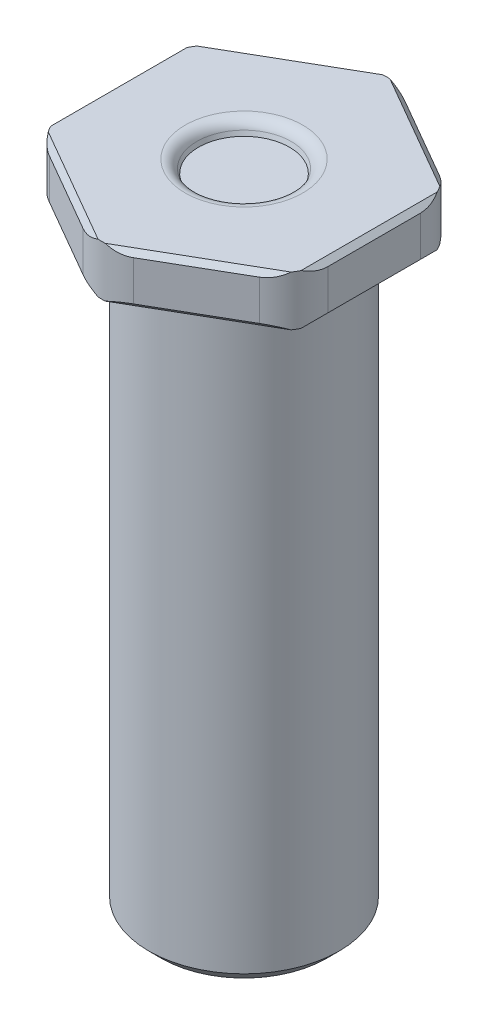
ISO-10303-21;
HEADER;
FILE_DESCRIPTION(('STEP AP214'),'2;1');
FILE_NAME('part.step','',(''),(''),'','','');
FILE_SCHEMA(('AUTOMOTIVE_DESIGN { 1 0 10303 214 1 1 1 1 }'));
ENDSEC;
DATA;
#1=APPLICATION_CONTEXT('core data for automotive mechanical design processes');
#2=APPLICATION_PROTOCOL_DEFINITION('international standard','automotive_design',2000,#1);
#3=PRODUCT_CONTEXT('',#1,'mechanical');
#4=PRODUCT('Part','Part','',(#3));
#5=PRODUCT_RELATED_PRODUCT_CATEGORY('part','',(#4));
#6=PRODUCT_DEFINITION_FORMATION('','',#4);
#7=PRODUCT_DEFINITION_CONTEXT('part definition',#1,'design');
#8=PRODUCT_DEFINITION('design','',#6,#7);
#9=PRODUCT_DEFINITION_SHAPE('','',#8);
#10=(LENGTH_UNIT() NAMED_UNIT(*) SI_UNIT(.MILLI.,.METRE.));
#11=(NAMED_UNIT(*) PLANE_ANGLE_UNIT() SI_UNIT($,.RADIAN.));
#12=(NAMED_UNIT(*) SI_UNIT($,.STERADIAN.) SOLID_ANGLE_UNIT());
#13=UNCERTAINTY_MEASURE_WITH_UNIT(LENGTH_MEASURE(1.E-05),#10,'distance_accuracy_value','');
#14=(GEOMETRIC_REPRESENTATION_CONTEXT(3) GLOBAL_UNCERTAINTY_ASSIGNED_CONTEXT((#13)) GLOBAL_UNIT_ASSIGNED_CONTEXT((#10,
#11,#12)) REPRESENTATION_CONTEXT('',''));
#15=CARTESIAN_POINT('',(0.,0.,0.));
#16=DIRECTION('',(0.,0.,1.));
#17=DIRECTION('',(1.,0.,0.));
#18=AXIS2_PLACEMENT_3D('',#15,#16,#17);
#19=CARTESIAN_POINT('',(0.,63.5,0.));
#20=DIRECTION('',(0.,-1.,0.));
#21=DIRECTION('',(0.,0.,-1.));
#22=AXIS2_PLACEMENT_3D('',#19,#20,#21);
#23=CYLINDRICAL_SURFACE('',#22,9.652);
#24=CARTESIAN_POINT('',(0.,1.27000000000002,0.));
#25=DIRECTION('',(0.,1.,0.));
#26=DIRECTION('',(0.,0.,1.));
#27=AXIS2_PLACEMENT_3D('',#24,#25,#26);
#28=CIRCLE('',#27,9.652);
#29=CARTESIAN_POINT('',(0.,1.27000000000002,9.652));
#30=VERTEX_POINT('',#29);
#31=EDGE_CURVE('E546',#30,#30,#28,.T.);
#32=ORIENTED_EDGE('',*,*,#31,.T.);
#33=EDGE_LOOP('',(#32));
#34=FACE_BOUND('',#33,.T.);
#35=CARTESIAN_POINT('',(0.,60.96,0.));
#36=DIRECTION('',(0.,1.,0.));
#37=DIRECTION('',(0.,0.,1.));
#38=AXIS2_PLACEMENT_3D('',#35,#36,#37);
#39=CIRCLE('',#38,9.652);
#40=CARTESIAN_POINT('',(0.,60.96,9.652));
#41=VERTEX_POINT('',#40);
#42=EDGE_CURVE('E538',#41,#41,#39,.T.);
#43=ORIENTED_EDGE('',*,*,#42,.F.);
#44=EDGE_LOOP('',(#43));
#45=FACE_BOUND('',#44,.T.);
#46=ADVANCED_FACE('F34',(#34,#45),#23,.T.);
#47=CARTESIAN_POINT('',(0.,0.,0.));
#48=DIRECTION('',(0.,1.,0.));
#49=DIRECTION('',(0.,0.,1.));
#50=AXIS2_PLACEMENT_3D('',#47,#48,#49);
#51=PLANE('',#50);
#52=CARTESIAN_POINT('',(0.,0.,0.));
#53=DIRECTION('',(0.,1.,0.));
#54=DIRECTION('',(0.,0.,1.));
#55=AXIS2_PLACEMENT_3D('',#52,#53,#54);
#56=CIRCLE('',#55,8.38199999999997);
#57=CARTESIAN_POINT('',(0.,0.,8.38199999999997));
#58=VERTEX_POINT('',#57);
#59=EDGE_CURVE('E541',#58,#58,#56,.F.);
#60=ORIENTED_EDGE('',*,*,#59,.T.);
#61=EDGE_LOOP('',(#60));
#62=FACE_BOUND('',#61,.T.);
#63=ADVANCED_FACE('F296',(#62),#51,.F.);
#64=CARTESIAN_POINT('',(0.,1.27000000000002,0.));
#65=DIRECTION('',(0.,1.,0.));
#66=DIRECTION('',(0.,0.,1.));
#67=AXIS2_PLACEMENT_3D('',#64,#65,#66);
#68=CONICAL_SURFACE('',#67,9.652,0.78539816339745);
#69=ORIENTED_EDGE('',*,*,#59,.F.);
#70=EDGE_LOOP('',(#69));
#71=FACE_BOUND('',#70,.T.);
#72=ORIENTED_EDGE('',*,*,#31,.F.);
#73=EDGE_LOOP('',(#72));
#74=FACE_BOUND('',#73,.T.);
#75=ADVANCED_FACE('F302',(#71,#74),#68,.T.);
#76=CARTESIAN_POINT('',(0.,60.96,0.));
#77=DIRECTION('',(0.,1.,0.));
#78=DIRECTION('',(0.,0.,1.));
#79=AXIS2_PLACEMENT_3D('',#76,#77,#78);
#80=PLANE('',#79);
#81=DIRECTION('',(0.,0.,-1.));
#82=VECTOR('',#81,1.);
#83=CARTESIAN_POINT('',(-12.6902271536748,60.96,0.));
#84=LINE('',#83,#82);
#85=CARTESIAN_POINT('',(-12.6902271536748,60.96,6.90138129583535));
#86=VERTEX_POINT('',#85);
#87=CARTESIAN_POINT('',(-12.6902271536748,60.96,-6.90138129583534));
#88=VERTEX_POINT('',#87);
#89=EDGE_CURVE('E437',#86,#88,#84,.T.);
#90=ORIENTED_EDGE('',*,*,#89,.T.);
#91=CARTESIAN_POINT('',(-8.11822715367484,60.96,-4.68706063251669));
#92=DIRECTION('',(0.,1.,0.));
#93=DIRECTION('',(0.,0.,1.));
#94=AXIS2_PLACEMENT_3D('',#91,#92,#93);
#95=CIRCLE('',#94,5.08);
#96=CARTESIAN_POINT('',(-12.3218851002336,60.96,-7.53936844695982));
#97=VERTEX_POINT('',#96);
#98=EDGE_CURVE('E466',#88,#97,#95,.F.);
#99=ORIENTED_EDGE('',*,*,#98,.T.);
#100=DIRECTION('',(0.866025403784439,0.,-0.5));
#101=VECTOR('',#100,1.);
#102=CARTESIAN_POINT('',(-6.34511357683742,60.96,-10.9900590948775));
#103=LINE('',#102,#101);
#104=CARTESIAN_POINT('',(-0.368342053441244,60.96,-14.4407497427952));
#105=VERTEX_POINT('',#104);
#106=EDGE_CURVE('E446',#97,#105,#103,.T.);
#107=ORIENTED_EDGE('',*,*,#106,.T.);
#108=CARTESIAN_POINT('',(0.,60.96,-9.37412126503338));
#109=DIRECTION('',(0.,1.,0.));
#110=DIRECTION('',(0.,0.,1.));
#111=AXIS2_PLACEMENT_3D('',#108,#109,#110);
#112=CIRCLE('',#111,5.08);
#113=CARTESIAN_POINT('',(0.368342053441237,60.96,-14.4407497427952));
#114=VERTEX_POINT('',#113);
#115=EDGE_CURVE('E462',#105,#114,#112,.F.);
#116=ORIENTED_EDGE('',*,*,#115,.T.);
#117=DIRECTION('',(0.866025403784439,0.,0.5));
#118=VECTOR('',#117,1.);
#119=CARTESIAN_POINT('',(6.34511357683741,60.96,-10.9900590948775));
#120=LINE('',#119,#118);
#121=CARTESIAN_POINT('',(12.3218851002336,60.96,-7.53936844695983));
#122=VERTEX_POINT('',#121);
#123=EDGE_CURVE('E210',#114,#122,#120,.T.);
#124=ORIENTED_EDGE('',*,*,#123,.T.);
#125=CARTESIAN_POINT('',(8.11822715367482,60.96,-4.6870606325167));
#126=DIRECTION('',(0.,1.,0.));
#127=DIRECTION('',(0.,0.,1.));
#128=AXIS2_PLACEMENT_3D('',#125,#126,#127);
#129=CIRCLE('',#128,5.08);
#130=CARTESIAN_POINT('',(12.6902271536748,60.96,-6.90138129583535));
#131=VERTEX_POINT('',#130);
#132=EDGE_CURVE('E460',#122,#131,#129,.F.);
#133=ORIENTED_EDGE('',*,*,#132,.T.);
#134=DIRECTION('',(0.,0.,1.));
#135=VECTOR('',#134,1.);
#136=CARTESIAN_POINT('',(12.6902271536748,60.96,0.));
#137=LINE('',#136,#135);
#138=CARTESIAN_POINT('',(12.6902271536748,60.96,6.90138129583534));
#139=VERTEX_POINT('',#138);
#140=EDGE_CURVE('E443',#131,#139,#137,.T.);
#141=ORIENTED_EDGE('',*,*,#140,.T.);
#142=CARTESIAN_POINT('',(8.11822715367482,60.96,4.6870606325167));
#143=DIRECTION('',(0.,1.,0.));
#144=DIRECTION('',(0.,0.,1.));
#145=AXIS2_PLACEMENT_3D('',#142,#143,#144);
#146=CIRCLE('',#145,5.08);
#147=CARTESIAN_POINT('',(12.3218851002336,60.96,7.53936844695984));
#148=VERTEX_POINT('',#147);
#149=EDGE_CURVE('E458',#139,#148,#146,.F.);
#150=ORIENTED_EDGE('',*,*,#149,.T.);
#151=DIRECTION('',(-0.866025403784439,0.,0.5));
#152=VECTOR('',#151,1.);
#153=CARTESIAN_POINT('',(6.34511357683742,60.96,10.9900590948775));
#154=LINE('',#153,#152);
#155=CARTESIAN_POINT('',(0.368342053441251,60.96,14.4407497427952));
#156=VERTEX_POINT('',#155);
#157=EDGE_CURVE('E440',#148,#156,#154,.T.);
#158=ORIENTED_EDGE('',*,*,#157,.T.);
#159=CARTESIAN_POINT('',(0.,60.96,9.37412126503338));
#160=DIRECTION('',(0.,1.,0.));
#161=DIRECTION('',(0.,0.,1.));
#162=AXIS2_PLACEMENT_3D('',#159,#160,#161);
#163=CIRCLE('',#162,5.08);
#164=CARTESIAN_POINT('',(-0.368342053441251,60.96,14.4407497427952));
#165=VERTEX_POINT('',#164);
#166=EDGE_CURVE('E456',#156,#165,#163,.F.);
#167=ORIENTED_EDGE('',*,*,#166,.T.);
#168=DIRECTION('',(-0.866025403784439,0.,-0.5));
#169=VECTOR('',#168,1.);
#170=CARTESIAN_POINT('',(-6.34511357683742,60.96,10.9900590948775));
#171=LINE('',#170,#169);
#172=CARTESIAN_POINT('',(-12.3218851002336,60.96,7.53936844695984));
#173=VERTEX_POINT('',#172);
#174=EDGE_CURVE('E434',#165,#173,#171,.T.);
#175=ORIENTED_EDGE('',*,*,#174,.T.);
#176=CARTESIAN_POINT('',(-8.11822715367483,60.96,4.68706063251669));
#177=DIRECTION('',(0.,1.,0.));
#178=DIRECTION('',(0.,0.,1.));
#179=AXIS2_PLACEMENT_3D('',#176,#177,#178);
#180=CIRCLE('',#179,5.08);
#181=EDGE_CURVE('E464',#173,#86,#180,.F.);
#182=ORIENTED_EDGE('',*,*,#181,.T.);
#183=EDGE_LOOP('',(#90,#99,#107,#116,#124,#133,#141,#150,#158,#167,#175,#182));
#184=FACE_BOUND('',#183,.T.);
#185=ORIENTED_EDGE('',*,*,#42,.T.);
#186=EDGE_LOOP('',(#185));
#187=FACE_BOUND('',#186,.T.);
#188=ADVANCED_FACE('F311',(#184,#187),#80,.F.);
#189=CARTESIAN_POINT('',(13.1982271536748,66.04,-7.62));
#190=DIRECTION('',(-0.5,0.,0.866025403784439));
#191=DIRECTION('',(0.866025403784439,0.,0.5));
#192=AXIS2_PLACEMENT_3D('',#189,#190,#191);
#193=PLANE('',#192);
#194=DIRECTION('',(-0.866025403784439,0.,-0.5));
#195=VECTOR('',#194,1.);
#196=CARTESIAN_POINT('',(13.1982271536748,61.468,-7.62));
#197=LINE('',#196,#195);
#198=CARTESIAN_POINT('',(10.6582271536748,61.468,-9.08646968374165));
#199=VERTEX_POINT('',#198);
#200=CARTESIAN_POINT('',(2.54,61.468,-13.7735303162583));
#201=VERTEX_POINT('',#200);
#202=EDGE_CURVE('E428',#199,#201,#197,.T.);
#203=ORIENTED_EDGE('',*,*,#202,.T.);
#204=DIRECTION('',(0.,-1.,0.));
#205=VECTOR('',#204,1.);
#206=CARTESIAN_POINT('',(2.54,66.04,-13.7735303162583));
#207=LINE('',#206,#205);
#208=CARTESIAN_POINT('',(2.54,65.532,-13.7735303162583));
#209=VERTEX_POINT('',#208);
#210=EDGE_CURVE('E251',#201,#209,#207,.F.);
#211=ORIENTED_EDGE('',*,*,#210,.T.);
#212=DIRECTION('',(0.866025403784439,0.,0.5));
#213=VECTOR('',#212,1.);
#214=CARTESIAN_POINT('',(13.1982271536748,65.532,-7.62));
#215=LINE('',#214,#213);
#216=CARTESIAN_POINT('',(10.6582271536748,65.532,-9.08646968374165));
#217=VERTEX_POINT('',#216);
#218=EDGE_CURVE('E431',#209,#217,#215,.T.);
#219=ORIENTED_EDGE('',*,*,#218,.T.);
#220=DIRECTION('',(0.,-1.,0.));
#221=VECTOR('',#220,1.);
#222=CARTESIAN_POINT('',(10.6582271536748,66.04,-9.08646968374165));
#223=LINE('',#222,#221);
#224=EDGE_CURVE('E248',#217,#199,#223,.T.);
#225=ORIENTED_EDGE('',*,*,#224,.T.);
#226=EDGE_LOOP('',(#203,#211,#219,#225));
#227=FACE_BOUND('',#226,.T.);
#228=ADVANCED_FACE('F556',(#227),#193,.F.);
#229=CARTESIAN_POINT('',(0.,66.04,-15.24));
#230=DIRECTION('',(0.5,0.,0.866025403784439));
#231=DIRECTION('',(0.866025403784439,0.,-0.5));
#232=AXIS2_PLACEMENT_3D('',#229,#230,#231);
#233=PLANE('',#232);
#234=DIRECTION('',(-0.866025403784439,0.,0.5));
#235=VECTOR('',#234,1.);
#236=CARTESIAN_POINT('',(0.,61.468,-15.24));
#237=LINE('',#236,#235);
#238=CARTESIAN_POINT('',(-2.54,61.468,-13.7735303162583));
#239=VERTEX_POINT('',#238);
#240=CARTESIAN_POINT('',(-10.6582271536748,61.468,-9.08646968374164));
#241=VERTEX_POINT('',#240);
#242=EDGE_CURVE('E219',#239,#241,#237,.T.);
#243=ORIENTED_EDGE('',*,*,#242,.T.);
#244=DIRECTION('',(0.,-1.,0.));
#245=VECTOR('',#244,1.);
#246=CARTESIAN_POINT('',(-10.6582271536748,66.04,-9.08646968374164));
#247=LINE('',#246,#245);
#248=CARTESIAN_POINT('',(-10.6582271536748,65.532,-9.08646968374164));
#249=VERTEX_POINT('',#248);
#250=EDGE_CURVE('E475',#241,#249,#247,.F.);
#251=ORIENTED_EDGE('',*,*,#250,.T.);
#252=DIRECTION('',(0.866025403784439,0.,-0.5));
#253=VECTOR('',#252,1.);
#254=CARTESIAN_POINT('',(0.,65.532,-15.24));
#255=LINE('',#254,#253);
#256=CARTESIAN_POINT('',(-2.54,65.532,-13.7735303162583));
#257=VERTEX_POINT('',#256);
#258=EDGE_CURVE('E425',#249,#257,#255,.T.);
#259=ORIENTED_EDGE('',*,*,#258,.T.);
#260=DIRECTION('',(0.,-1.,0.));
#261=VECTOR('',#260,1.);
#262=CARTESIAN_POINT('',(-2.54,66.04,-13.7735303162583));
#263=LINE('',#262,#261);
#264=EDGE_CURVE('E472',#257,#239,#263,.T.);
#265=ORIENTED_EDGE('',*,*,#264,.T.);
#266=EDGE_LOOP('',(#243,#251,#259,#265));
#267=FACE_BOUND('',#266,.T.);
#268=ADVANCED_FACE('F501',(#267),#233,.F.);
#269=CARTESIAN_POINT('',(-13.1982271536748,66.04,-7.61999999999999));
#270=DIRECTION('',(1.,0.,0.));
#271=DIRECTION('',(0.,0.,-1.));
#272=AXIS2_PLACEMENT_3D('',#269,#270,#271);
#273=PLANE('',#272);
#274=DIRECTION('',(0.,0.,-1.));
#275=VECTOR('',#274,1.);
#276=CARTESIAN_POINT('',(-13.1982271536748,65.532,-7.61999999999999));
#277=LINE('',#276,#275);
#278=CARTESIAN_POINT('',(-13.1982271536748,65.532,4.68706063251669));
#279=VERTEX_POINT('',#278);
#280=CARTESIAN_POINT('',(-13.1982271536748,65.532,-4.68706063251669));
#281=VERTEX_POINT('',#280);
#282=EDGE_CURVE('E202',#279,#281,#277,.T.);
#283=ORIENTED_EDGE('',*,*,#282,.T.);
#284=DIRECTION('',(0.,-1.,0.));
#285=VECTOR('',#284,1.);
#286=CARTESIAN_POINT('',(-13.1982271536748,66.04,-4.68706063251669));
#287=LINE('',#286,#285);
#288=CARTESIAN_POINT('',(-13.1982271536748,61.468,-4.68706063251669));
#289=VERTEX_POINT('',#288);
#290=EDGE_CURVE('E209',#281,#289,#287,.T.);
#291=ORIENTED_EDGE('',*,*,#290,.T.);
#292=DIRECTION('',(0.,0.,1.));
#293=VECTOR('',#292,1.);
#294=CARTESIAN_POINT('',(-13.1982271536748,61.468,-7.61999999999999));
#295=LINE('',#294,#293);
#296=CARTESIAN_POINT('',(-13.1982271536748,61.468,4.68706063251669));
#297=VERTEX_POINT('',#296);
#298=EDGE_CURVE('E205',#289,#297,#295,.T.);
#299=ORIENTED_EDGE('',*,*,#298,.T.);
#300=DIRECTION('',(0.,-1.,0.));
#301=VECTOR('',#300,1.);
#302=CARTESIAN_POINT('',(-13.1982271536748,66.04,4.68706063251669));
#303=LINE('',#302,#301);
#304=EDGE_CURVE('E198',#297,#279,#303,.F.);
#305=ORIENTED_EDGE('',*,*,#304,.T.);
#306=EDGE_LOOP('',(#283,#291,#299,#305));
#307=FACE_BOUND('',#306,.T.);
#308=ADVANCED_FACE('F200',(#307),#273,.F.);
#309=CARTESIAN_POINT('',(-13.1982271536748,66.04,7.62));
#310=DIRECTION('',(0.5,0.,-0.866025403784439));
#311=DIRECTION('',(-0.866025403784439,0.,-0.5));
#312=AXIS2_PLACEMENT_3D('',#309,#310,#311);
#313=PLANE('',#312);
#314=DIRECTION('',(-0.866025403784439,0.,-0.5));
#315=VECTOR('',#314,1.);
#316=CARTESIAN_POINT('',(-13.1982271536748,65.532,7.62));
#317=LINE('',#316,#315);
#318=CARTESIAN_POINT('',(-2.54,65.532,13.7735303162583));
#319=VERTEX_POINT('',#318);
#320=CARTESIAN_POINT('',(-10.6582271536748,65.532,9.08646968374164));
#321=VERTEX_POINT('',#320);
#322=EDGE_CURVE('E393',#319,#321,#317,.T.);
#323=ORIENTED_EDGE('',*,*,#322,.T.);
#324=DIRECTION('',(0.,-1.,0.));
#325=VECTOR('',#324,1.);
#326=CARTESIAN_POINT('',(-10.6582271536748,66.04,9.08646968374164));
#327=LINE('',#326,#325);
#328=CARTESIAN_POINT('',(-10.6582271536748,61.468,9.08646968374164));
#329=VERTEX_POINT('',#328);
#330=EDGE_CURVE('E233',#321,#329,#327,.T.);
#331=ORIENTED_EDGE('',*,*,#330,.T.);
#332=DIRECTION('',(0.866025403784439,0.,0.5));
#333=VECTOR('',#332,1.);
#334=CARTESIAN_POINT('',(-13.1982271536748,61.468,7.62));
#335=LINE('',#334,#333);
#336=CARTESIAN_POINT('',(-2.54,61.468,13.7735303162583));
#337=VERTEX_POINT('',#336);
#338=EDGE_CURVE('E418',#329,#337,#335,.T.);
#339=ORIENTED_EDGE('',*,*,#338,.T.);
#340=DIRECTION('',(0.,-1.,0.));
#341=VECTOR('',#340,1.);
#342=CARTESIAN_POINT('',(-2.54,66.04,13.7735303162583));
#343=LINE('',#342,#341);
#344=EDGE_CURVE('E227',#337,#319,#343,.F.);
#345=ORIENTED_EDGE('',*,*,#344,.T.);
#346=EDGE_LOOP('',(#323,#331,#339,#345));
#347=FACE_BOUND('',#346,.T.);
#348=ADVANCED_FACE('F568',(#347),#313,.F.);
#349=CARTESIAN_POINT('',(0.,66.04,15.24));
#350=DIRECTION('',(-0.5,0.,-0.866025403784439));
#351=DIRECTION('',(-0.866025403784439,0.,0.5));
#352=AXIS2_PLACEMENT_3D('',#349,#350,#351);
#353=PLANE('',#352);
#354=DIRECTION('',(0.866025403784439,0.,-0.5));
#355=VECTOR('',#354,1.);
#356=CARTESIAN_POINT('',(0.,61.468,15.24));
#357=LINE('',#356,#355);
#358=CARTESIAN_POINT('',(2.54,61.468,13.7735303162583));
#359=VERTEX_POINT('',#358);
#360=CARTESIAN_POINT('',(10.6582271536748,61.468,9.08646968374165));
#361=VERTEX_POINT('',#360);
#362=EDGE_CURVE('E414',#359,#361,#357,.T.);
#363=ORIENTED_EDGE('',*,*,#362,.T.);
#364=DIRECTION('',(0.,-1.,0.));
#365=VECTOR('',#364,1.);
#366=CARTESIAN_POINT('',(10.6582271536748,66.04,9.08646968374165));
#367=LINE('',#366,#365);
#368=CARTESIAN_POINT('',(10.6582271536748,65.532,9.08646968374165));
#369=VERTEX_POINT('',#368);
#370=EDGE_CURVE('E56',#361,#369,#367,.F.);
#371=ORIENTED_EDGE('',*,*,#370,.T.);
#372=DIRECTION('',(-0.866025403784439,0.,0.5));
#373=VECTOR('',#372,1.);
#374=CARTESIAN_POINT('',(0.,65.532,15.24));
#375=LINE('',#374,#373);
#376=CARTESIAN_POINT('',(2.54,65.532,13.7735303162583));
#377=VERTEX_POINT('',#376);
#378=EDGE_CURVE('E416',#369,#377,#375,.T.);
#379=ORIENTED_EDGE('',*,*,#378,.T.);
#380=DIRECTION('',(0.,-1.,0.));
#381=VECTOR('',#380,1.);
#382=CARTESIAN_POINT('',(2.54,66.04,13.7735303162583));
#383=LINE('',#382,#381);
#384=EDGE_CURVE('E274',#377,#359,#383,.T.);
#385=ORIENTED_EDGE('',*,*,#384,.T.);
#386=EDGE_LOOP('',(#363,#371,#379,#385));
#387=FACE_BOUND('',#386,.T.);
#388=ADVANCED_FACE('F517',(#387),#353,.F.);
#389=CARTESIAN_POINT('',(13.1982271536748,66.04,7.62));
#390=DIRECTION('',(-1.,0.,0.));
#391=DIRECTION('',(0.,0.,1.));
#392=AXIS2_PLACEMENT_3D('',#389,#390,#391);
#393=PLANE('',#392);
#394=DIRECTION('',(0.,0.,-1.));
#395=VECTOR('',#394,1.);
#396=CARTESIAN_POINT('',(13.1982271536748,61.468,7.62));
#397=LINE('',#396,#395);
#398=CARTESIAN_POINT('',(13.1982271536748,61.468,4.68706063251669));
#399=VERTEX_POINT('',#398);
#400=CARTESIAN_POINT('',(13.1982271536748,61.468,-4.6870606325167));
#401=VERTEX_POINT('',#400);
#402=EDGE_CURVE('E408',#399,#401,#397,.T.);
#403=ORIENTED_EDGE('',*,*,#402,.T.);
#404=DIRECTION('',(0.,-1.,0.));
#405=VECTOR('',#404,1.);
#406=CARTESIAN_POINT('',(13.1982271536748,66.04,-4.6870606325167));
#407=LINE('',#406,#405);
#408=CARTESIAN_POINT('',(13.1982271536748,65.532,-4.6870606325167));
#409=VERTEX_POINT('',#408);
#410=EDGE_CURVE('E264',#401,#409,#407,.F.);
#411=ORIENTED_EDGE('',*,*,#410,.T.);
#412=DIRECTION('',(0.,0.,1.));
#413=VECTOR('',#412,1.);
#414=CARTESIAN_POINT('',(13.1982271536748,65.532,7.62));
#415=LINE('',#414,#413);
#416=CARTESIAN_POINT('',(13.1982271536748,65.532,4.68706063251669));
#417=VERTEX_POINT('',#416);
#418=EDGE_CURVE('E411',#409,#417,#415,.T.);
#419=ORIENTED_EDGE('',*,*,#418,.T.);
#420=DIRECTION('',(0.,-1.,0.));
#421=VECTOR('',#420,1.);
#422=CARTESIAN_POINT('',(13.1982271536748,66.04,4.68706063251669));
#423=LINE('',#422,#421);
#424=EDGE_CURVE('E261',#417,#399,#423,.T.);
#425=ORIENTED_EDGE('',*,*,#424,.T.);
#426=EDGE_LOOP('',(#403,#411,#419,#425));
#427=FACE_BOUND('',#426,.T.);
#428=ADVANCED_FACE('F530',(#427),#393,.F.);
#429=CARTESIAN_POINT('',(0.,66.04,0.));
#430=DIRECTION('',(0.,1.,0.));
#431=DIRECTION('',(0.,0.,1.));
#432=AXIS2_PLACEMENT_3D('',#429,#430,#431);
#433=PLANE('',#432);
#434=CARTESIAN_POINT('',(0.,66.04,0.));
#435=DIRECTION('',(0.,1.,0.));
#436=DIRECTION('',(0.,0.,1.));
#437=AXIS2_PLACEMENT_3D('',#434,#435,#436);
#438=CIRCLE('',#437,5.96926357352633);
#439=CARTESIAN_POINT('',(0.,66.04,5.96926357352633));
#440=VERTEX_POINT('',#439);
#441=EDGE_CURVE('E11',#440,#440,#438,.F.);
#442=ORIENTED_EDGE('',*,*,#441,.T.);
#443=EDGE_LOOP('',(#442));
#444=FACE_BOUND('',#443,.T.);
#445=DIRECTION('',(-0.866025403784439,0.,0.5));
#446=VECTOR('',#445,1.);
#447=CARTESIAN_POINT('',(-12.9442271536748,66.04,-7.1800590948775));
#448=LINE('',#447,#446);
#449=CARTESIAN_POINT('',(-0.36834205344124,66.04,-14.4407497427952));
#450=VERTEX_POINT('',#449);
#451=CARTESIAN_POINT('',(-12.3218851002336,66.04,-7.53936844695982));
#452=VERTEX_POINT('',#451);
#453=EDGE_CURVE('E402',#450,#452,#448,.T.);
#454=ORIENTED_EDGE('',*,*,#453,.T.);
#455=CARTESIAN_POINT('',(-8.11822715367484,66.04,-4.68706063251669));
#456=DIRECTION('',(0.,1.,0.));
#457=DIRECTION('',(0.,0.,1.));
#458=AXIS2_PLACEMENT_3D('',#455,#456,#457);
#459=CIRCLE('',#458,5.08);
#460=CARTESIAN_POINT('',(-12.6902271536748,66.04,-6.90138129583534));
#461=VERTEX_POINT('',#460);
#462=EDGE_CURVE('E225',#452,#461,#459,.T.);
#463=ORIENTED_EDGE('',*,*,#462,.T.);
#464=DIRECTION('',(0.,0.,1.));
#465=VECTOR('',#464,1.);
#466=CARTESIAN_POINT('',(-12.6902271536748,66.04,7.62));
#467=LINE('',#466,#465);
#468=CARTESIAN_POINT('',(-12.6902271536748,66.04,6.90138129583535));
#469=VERTEX_POINT('',#468);
#470=EDGE_CURVE('E398',#461,#469,#467,.T.);
#471=ORIENTED_EDGE('',*,*,#470,.T.);
#472=CARTESIAN_POINT('',(-8.11822715367483,66.04,4.68706063251669));
#473=DIRECTION('',(0.,1.,0.));
#474=DIRECTION('',(0.,0.,1.));
#475=AXIS2_PLACEMENT_3D('',#472,#473,#474);
#476=CIRCLE('',#475,5.08);
#477=CARTESIAN_POINT('',(-12.3218851002336,66.04,7.53936844695983));
#478=VERTEX_POINT('',#477);
#479=EDGE_CURVE('E224',#469,#478,#476,.T.);
#480=ORIENTED_EDGE('',*,*,#479,.T.);
#481=DIRECTION('',(0.866025403784439,0.,0.5));
#482=VECTOR('',#481,1.);
#483=CARTESIAN_POINT('',(0.253999999999995,66.04,14.8000590948775));
#484=LINE('',#483,#482);
#485=CARTESIAN_POINT('',(-0.368342053441251,66.04,14.4407497427952));
#486=VERTEX_POINT('',#485);
#487=EDGE_CURVE('E391',#478,#486,#484,.T.);
#488=ORIENTED_EDGE('',*,*,#487,.T.);
#489=CARTESIAN_POINT('',(0.,66.04,9.37412126503338));
#490=DIRECTION('',(0.,1.,0.));
#491=DIRECTION('',(0.,0.,1.));
#492=AXIS2_PLACEMENT_3D('',#489,#490,#491);
#493=CIRCLE('',#492,5.08);
#494=CARTESIAN_POINT('',(0.368342053441252,66.04,14.4407497427952));
#495=VERTEX_POINT('',#494);
#496=EDGE_CURVE('E387',#486,#495,#493,.T.);
#497=ORIENTED_EDGE('',*,*,#496,.T.);
#498=DIRECTION('',(0.866025403784439,0.,-0.5));
#499=VECTOR('',#498,1.);
#500=CARTESIAN_POINT('',(12.9442271536748,66.04,7.18005909487751));
#501=LINE('',#500,#499);
#502=CARTESIAN_POINT('',(12.3218851002336,66.04,7.53936844695984));
#503=VERTEX_POINT('',#502);
#504=EDGE_CURVE('E397',#495,#503,#501,.T.);
#505=ORIENTED_EDGE('',*,*,#504,.T.);
#506=CARTESIAN_POINT('',(8.11822715367482,66.04,4.6870606325167));
#507=DIRECTION('',(0.,1.,0.));
#508=DIRECTION('',(0.,0.,1.));
#509=AXIS2_PLACEMENT_3D('',#506,#507,#508);
#510=CIRCLE('',#509,5.08);
#511=CARTESIAN_POINT('',(12.6902271536748,66.04,6.90138129583534));
#512=VERTEX_POINT('',#511);
#513=EDGE_CURVE('E482',#503,#512,#510,.T.);
#514=ORIENTED_EDGE('',*,*,#513,.T.);
#515=DIRECTION('',(0.,0.,-1.));
#516=VECTOR('',#515,1.);
#517=CARTESIAN_POINT('',(12.6902271536748,66.04,-7.62));
#518=LINE('',#517,#516);
#519=CARTESIAN_POINT('',(12.6902271536748,66.04,-6.90138129583535));
#520=VERTEX_POINT('',#519);
#521=EDGE_CURVE('E400',#512,#520,#518,.T.);
#522=ORIENTED_EDGE('',*,*,#521,.T.);
#523=CARTESIAN_POINT('',(8.11822715367482,66.04,-4.6870606325167));
#524=DIRECTION('',(0.,1.,0.));
#525=DIRECTION('',(0.,0.,1.));
#526=AXIS2_PLACEMENT_3D('',#523,#524,#525);
#527=CIRCLE('',#526,5.08);
#528=CARTESIAN_POINT('',(12.3218851002336,66.04,-7.53936844695984));
#529=VERTEX_POINT('',#528);
#530=EDGE_CURVE('E484',#520,#529,#527,.T.);
#531=ORIENTED_EDGE('',*,*,#530,.T.);
#532=DIRECTION('',(-0.866025403784439,0.,-0.5));
#533=VECTOR('',#532,1.);
#534=CARTESIAN_POINT('',(-0.253999999999997,66.04,-14.8000590948775));
#535=LINE('',#534,#533);
#536=CARTESIAN_POINT('',(0.36834205344124,66.04,-14.4407497427952));
#537=VERTEX_POINT('',#536);
#538=EDGE_CURVE('E492',#529,#537,#535,.T.);
#539=ORIENTED_EDGE('',*,*,#538,.T.);
#540=CARTESIAN_POINT('',(0.,66.04,-9.37412126503338));
#541=DIRECTION('',(0.,1.,0.));
#542=DIRECTION('',(0.,0.,1.));
#543=AXIS2_PLACEMENT_3D('',#540,#541,#542);
#544=CIRCLE('',#543,5.08);
#545=EDGE_CURVE('E486',#537,#450,#544,.T.);
#546=ORIENTED_EDGE('',*,*,#545,.T.);
#547=EDGE_LOOP('',(#454,#463,#471,#480,#488,#497,#505,#514,#522,#531,#539,#546));
#548=FACE_BOUND('',#547,.T.);
#549=ADVANCED_FACE('F335',(#444,#548),#433,.T.);
#550=CARTESIAN_POINT('',(-12.6902271536748,66.04,0.));
#551=DIRECTION('',(-0.707106781186548,0.707106781186548,0.));
#552=DIRECTION('',(0.,0.,-1.));
#553=AXIS2_PLACEMENT_3D('',#550,#551,#552);
#554=PLANE('',#553);
#555=ORIENTED_EDGE('',*,*,#470,.F.);
#556=CARTESIAN_POINT('',(-8.11822715367484,70.612,-4.68706063251669));
#557=DIRECTION('',(-0.707106781186548,0.707106781186548,0.));
#558=DIRECTION('',(-0.707106781186548,-0.707106781186548,0.));
#559=AXIS2_PLACEMENT_3D('',#556,#557,#558);
#560=ELLIPSE('',#559,7.18420489685532,5.08);
#561=EDGE_CURVE('E218',#461,#281,#560,.T.);
#562=ORIENTED_EDGE('',*,*,#561,.T.);
#563=ORIENTED_EDGE('',*,*,#282,.F.);
#564=CARTESIAN_POINT('',(-8.11822715367483,70.612,4.68706063251669));
#565=DIRECTION('',(-0.707106781186548,0.707106781186548,0.));
#566=DIRECTION('',(-0.707106781186548,-0.707106781186548,0.));
#567=AXIS2_PLACEMENT_3D('',#564,#565,#566);
#568=ELLIPSE('',#567,7.18420489685532,5.08);
#569=EDGE_CURVE('E215',#279,#469,#568,.T.);
#570=ORIENTED_EDGE('',*,*,#569,.T.);
#571=EDGE_LOOP('',(#555,#562,#563,#570));
#572=FACE_BOUND('',#571,.T.);
#573=ADVANCED_FACE('F214',(#572),#554,.T.);
#574=CARTESIAN_POINT('',(-6.34511357683742,66.04,10.9900590948775));
#575=DIRECTION('',(-0.353553390593274,0.707106781186547,0.612372435695795));
#576=DIRECTION('',(-0.866025403784439,0.,-0.5));
#577=AXIS2_PLACEMENT_3D('',#574,#575,#576);
#578=PLANE('',#577);
#579=ORIENTED_EDGE('',*,*,#487,.F.);
#580=CARTESIAN_POINT('',(-8.11822715367483,70.612,4.68706063251669));
#581=DIRECTION('',(-0.353553390593274,0.707106781186547,0.612372435695795));
#582=DIRECTION('',(-0.353553390593273,-0.707106781186549,0.612372435695794));
#583=AXIS2_PLACEMENT_3D('',#580,#581,#582);
#584=ELLIPSE('',#583,7.18420489685533,5.08);
#585=EDGE_CURVE('E242',#478,#321,#584,.T.);
#586=ORIENTED_EDGE('',*,*,#585,.T.);
#587=ORIENTED_EDGE('',*,*,#322,.F.);
#588=CARTESIAN_POINT('',(0.,70.612,9.37412126503338));
#589=DIRECTION('',(-0.353553390593274,0.707106781186547,0.612372435695795));
#590=DIRECTION('',(-0.353553390593273,-0.707106781186549,0.612372435695794));
#591=AXIS2_PLACEMENT_3D('',#588,#589,#590);
#592=ELLIPSE('',#591,7.18420489685533,5.08);
#593=EDGE_CURVE('E240',#319,#486,#592,.T.);
#594=ORIENTED_EDGE('',*,*,#593,.T.);
#595=EDGE_LOOP('',(#579,#586,#587,#594));
#596=FACE_BOUND('',#595,.T.);
#597=ADVANCED_FACE('F328',(#596),#578,.T.);
#598=CARTESIAN_POINT('',(-6.34511357683742,66.04,-10.9900590948775));
#599=DIRECTION('',(-0.353553390593274,0.707106781186547,-0.612372435695795));
#600=DIRECTION('',(0.866025403784439,0.,-0.5));
#601=AXIS2_PLACEMENT_3D('',#598,#599,#600);
#602=PLANE('',#601);
#603=ORIENTED_EDGE('',*,*,#258,.F.);
#604=CARTESIAN_POINT('',(-8.11822715367484,70.612,-4.68706063251669));
#605=DIRECTION('',(-0.353553390593274,0.707106781186547,-0.612372435695795));
#606=DIRECTION('',(-0.353553390593274,-0.707106781186548,-0.612372435695794));
#607=AXIS2_PLACEMENT_3D('',#604,#605,#606);
#608=ELLIPSE('',#607,7.18420489685533,5.08);
#609=EDGE_CURVE('E479',#249,#452,#608,.T.);
#610=ORIENTED_EDGE('',*,*,#609,.T.);
#611=ORIENTED_EDGE('',*,*,#453,.F.);
#612=CARTESIAN_POINT('',(0.,70.612,-9.37412126503338));
#613=DIRECTION('',(-0.353553390593274,0.707106781186547,-0.612372435695795));
#614=DIRECTION('',(-0.353553390593274,-0.707106781186548,-0.612372435695794));
#615=AXIS2_PLACEMENT_3D('',#612,#613,#614);
#616=ELLIPSE('',#615,7.18420489685533,5.08);
#617=EDGE_CURVE('E477',#450,#257,#616,.T.);
#618=ORIENTED_EDGE('',*,*,#617,.T.);
#619=EDGE_LOOP('',(#603,#610,#611,#618));
#620=FACE_BOUND('',#619,.T.);
#621=ADVANCED_FACE('F325',(#620),#602,.T.);
#622=CARTESIAN_POINT('',(6.34511357683742,66.04,10.9900590948775));
#623=DIRECTION('',(0.353553390593274,0.707106781186547,0.612372435695795));
#624=DIRECTION('',(-0.866025403784439,0.,0.5));
#625=AXIS2_PLACEMENT_3D('',#622,#623,#624);
#626=PLANE('',#625);
#627=ORIENTED_EDGE('',*,*,#378,.F.);
#628=CARTESIAN_POINT('',(8.11822715367482,70.612,4.6870606325167));
#629=DIRECTION('',(0.353553390593274,0.707106781186547,0.612372435695795));
#630=DIRECTION('',(0.353553390593273,-0.707106781186548,0.612372435695794));
#631=AXIS2_PLACEMENT_3D('',#628,#629,#630);
#632=ELLIPSE('',#631,7.18420489685533,5.08);
#633=EDGE_CURVE('E279',#369,#503,#632,.T.);
#634=ORIENTED_EDGE('',*,*,#633,.T.);
#635=ORIENTED_EDGE('',*,*,#504,.F.);
#636=CARTESIAN_POINT('',(0.,70.612,9.37412126503338));
#637=DIRECTION('',(0.353553390593274,0.707106781186547,0.612372435695795));
#638=DIRECTION('',(0.353553390593273,-0.707106781186548,0.612372435695794));
#639=AXIS2_PLACEMENT_3D('',#636,#637,#638);
#640=ELLIPSE('',#639,7.18420489685533,5.08);
#641=EDGE_CURVE('E49',#495,#377,#640,.T.);
#642=ORIENTED_EDGE('',*,*,#641,.T.);
#643=EDGE_LOOP('',(#627,#634,#635,#642));
#644=FACE_BOUND('',#643,.T.);
#645=ADVANCED_FACE('F321',(#644),#626,.T.);
#646=CARTESIAN_POINT('',(6.34511357683742,66.04,-10.9900590948775));
#647=DIRECTION('',(0.353553390593274,0.707106781186547,-0.612372435695795));
#648=DIRECTION('',(0.866025403784439,0.,0.5));
#649=AXIS2_PLACEMENT_3D('',#646,#647,#648);
#650=PLANE('',#649);
#651=ORIENTED_EDGE('',*,*,#218,.F.);
#652=CARTESIAN_POINT('',(0.,70.612,-9.37412126503338));
#653=DIRECTION('',(0.353553390593274,0.707106781186547,-0.612372435695795));
#654=DIRECTION('',(0.353553390593273,-0.707106781186548,-0.612372435695794));
#655=AXIS2_PLACEMENT_3D('',#652,#653,#654);
#656=ELLIPSE('',#655,7.18420489685533,5.08);
#657=EDGE_CURVE('E255',#209,#537,#656,.T.);
#658=ORIENTED_EDGE('',*,*,#657,.T.);
#659=ORIENTED_EDGE('',*,*,#538,.F.);
#660=CARTESIAN_POINT('',(8.11822715367482,70.612,-4.6870606325167));
#661=DIRECTION('',(0.353553390593274,0.707106781186547,-0.612372435695795));
#662=DIRECTION('',(0.353553390593273,-0.707106781186548,-0.612372435695794));
#663=AXIS2_PLACEMENT_3D('',#660,#661,#662);
#664=ELLIPSE('',#663,7.18420489685533,5.08);
#665=EDGE_CURVE('E253',#529,#217,#664,.T.);
#666=ORIENTED_EDGE('',*,*,#665,.T.);
#667=EDGE_LOOP('',(#651,#658,#659,#666));
#668=FACE_BOUND('',#667,.T.);
#669=ADVANCED_FACE('F317',(#668),#650,.T.);
#670=CARTESIAN_POINT('',(12.6902271536748,66.04,0.));
#671=DIRECTION('',(0.707106781186548,0.707106781186547,0.));
#672=DIRECTION('',(0.,0.,1.));
#673=AXIS2_PLACEMENT_3D('',#670,#671,#672);
#674=PLANE('',#673);
#675=ORIENTED_EDGE('',*,*,#418,.F.);
#676=CARTESIAN_POINT('',(8.11822715367482,70.612,-4.6870606325167));
#677=DIRECTION('',(0.707106781186548,0.707106781186547,0.));
#678=DIRECTION('',(0.707106781186547,-0.707106781186548,0.));
#679=AXIS2_PLACEMENT_3D('',#676,#677,#678);
#680=ELLIPSE('',#679,7.18420489685533,5.08);
#681=EDGE_CURVE('E268',#409,#520,#680,.T.);
#682=ORIENTED_EDGE('',*,*,#681,.T.);
#683=ORIENTED_EDGE('',*,*,#521,.F.);
#684=CARTESIAN_POINT('',(8.11822715367482,70.612,4.6870606325167));
#685=DIRECTION('',(0.707106781186548,0.707106781186547,0.));
#686=DIRECTION('',(0.707106781186547,-0.707106781186548,0.));
#687=AXIS2_PLACEMENT_3D('',#684,#685,#686);
#688=ELLIPSE('',#687,7.18420489685533,5.08);
#689=EDGE_CURVE('E266',#512,#417,#688,.T.);
#690=ORIENTED_EDGE('',*,*,#689,.T.);
#691=EDGE_LOOP('',(#675,#682,#683,#690));
#692=FACE_BOUND('',#691,.T.);
#693=ADVANCED_FACE('F313',(#692),#674,.T.);
#694=CARTESIAN_POINT('',(-13.1982271536748,61.468,7.62));
#695=DIRECTION('',(0.353553390593274,0.707106781186547,-0.612372435695795));
#696=DIRECTION('',(0.866025403784439,0.,0.5));
#697=AXIS2_PLACEMENT_3D('',#694,#695,#696);
#698=PLANE('',#697);
#699=ORIENTED_EDGE('',*,*,#338,.F.);
#700=CARTESIAN_POINT('',(-8.11822715367483,56.388,4.68706063251669));
#701=DIRECTION('',(0.353553390593274,0.707106781186547,-0.612372435695795));
#702=DIRECTION('',(0.353553390593273,-0.707106781186549,-0.612372435695794));
#703=AXIS2_PLACEMENT_3D('',#700,#701,#702);
#704=ELLIPSE('',#703,7.18420489685533,5.08);
#705=EDGE_CURVE('E238',#329,#173,#704,.F.);
#706=ORIENTED_EDGE('',*,*,#705,.T.);
#707=ORIENTED_EDGE('',*,*,#174,.F.);
#708=CARTESIAN_POINT('',(0.,56.388,9.37412126503338));
#709=DIRECTION('',(0.353553390593274,0.707106781186547,-0.612372435695795));
#710=DIRECTION('',(0.353553390593273,-0.707106781186549,-0.612372435695794));
#711=AXIS2_PLACEMENT_3D('',#708,#709,#710);
#712=ELLIPSE('',#711,7.18420489685533,5.08);
#713=EDGE_CURVE('E236',#165,#337,#712,.F.);
#714=ORIENTED_EDGE('',*,*,#713,.T.);
#715=EDGE_LOOP('',(#699,#706,#707,#714));
#716=FACE_BOUND('',#715,.T.);
#717=ADVANCED_FACE('F316',(#716),#698,.F.);
#718=CARTESIAN_POINT('',(0.,61.468,15.24));
#719=DIRECTION('',(-0.353553390593274,0.707106781186547,-0.612372435695795));
#720=DIRECTION('',(0.866025403784439,0.,-0.5));
#721=AXIS2_PLACEMENT_3D('',#718,#719,#720);
#722=PLANE('',#721);
#723=ORIENTED_EDGE('',*,*,#157,.F.);
#724=CARTESIAN_POINT('',(8.11822715367482,56.388,4.6870606325167));
#725=DIRECTION('',(-0.353553390593274,0.707106781186547,-0.612372435695795));
#726=DIRECTION('',(-0.353553390593273,-0.707106781186548,-0.612372435695794));
#727=AXIS2_PLACEMENT_3D('',#724,#725,#726);
#728=ELLIPSE('',#727,7.18420489685533,5.08);
#729=EDGE_CURVE('E272',#148,#361,#728,.F.);
#730=ORIENTED_EDGE('',*,*,#729,.T.);
#731=ORIENTED_EDGE('',*,*,#362,.F.);
#732=CARTESIAN_POINT('',(0.,56.388,9.37412126503338));
#733=DIRECTION('',(-0.353553390593274,0.707106781186547,-0.612372435695795));
#734=DIRECTION('',(-0.353553390593273,-0.707106781186548,-0.612372435695794));
#735=AXIS2_PLACEMENT_3D('',#732,#733,#734);
#736=ELLIPSE('',#735,7.18420489685533,5.08);
#737=EDGE_CURVE('E270',#359,#156,#736,.F.);
#738=ORIENTED_EDGE('',*,*,#737,.T.);
#739=EDGE_LOOP('',(#723,#730,#731,#738));
#740=FACE_BOUND('',#739,.T.);
#741=ADVANCED_FACE('F352',(#740),#722,.F.);
#742=CARTESIAN_POINT('',(-13.1982271536748,61.468,-7.61999999999999));
#743=DIRECTION('',(0.707106781186548,0.707106781186548,0.));
#744=DIRECTION('',(0.,0.,1.));
#745=AXIS2_PLACEMENT_3D('',#742,#743,#744);
#746=PLANE('',#745);
#747=ORIENTED_EDGE('',*,*,#298,.F.);
#748=CARTESIAN_POINT('',(-8.11822715367484,56.388,-4.68706063251669));
#749=DIRECTION('',(0.707106781186548,0.707106781186548,0.));
#750=DIRECTION('',(0.707106781186548,-0.707106781186548,0.));
#751=AXIS2_PLACEMENT_3D('',#748,#749,#750);
#752=ELLIPSE('',#751,7.18420489685532,5.08);
#753=EDGE_CURVE('E454',#289,#88,#752,.F.);
#754=ORIENTED_EDGE('',*,*,#753,.T.);
#755=ORIENTED_EDGE('',*,*,#89,.F.);
#756=CARTESIAN_POINT('',(-8.11822715367483,56.388,4.68706063251669));
#757=DIRECTION('',(0.707106781186548,0.707106781186548,0.));
#758=DIRECTION('',(0.707106781186548,-0.707106781186548,0.));
#759=AXIS2_PLACEMENT_3D('',#756,#757,#758);
#760=ELLIPSE('',#759,7.18420489685532,5.08);
#761=EDGE_CURVE('E452',#86,#297,#760,.F.);
#762=ORIENTED_EDGE('',*,*,#761,.T.);
#763=EDGE_LOOP('',(#747,#754,#755,#762));
#764=FACE_BOUND('',#763,.T.);
#765=ADVANCED_FACE('F348',(#764),#746,.F.);
#766=CARTESIAN_POINT('',(13.1982271536748,61.468,7.62));
#767=DIRECTION('',(-0.707106781186548,0.707106781186547,0.));
#768=DIRECTION('',(0.,0.,-1.));
#769=AXIS2_PLACEMENT_3D('',#766,#767,#768);
#770=PLANE('',#769);
#771=ORIENTED_EDGE('',*,*,#140,.F.);
#772=CARTESIAN_POINT('',(8.11822715367482,56.388,-4.6870606325167));
#773=DIRECTION('',(-0.707106781186548,0.707106781186547,0.));
#774=DIRECTION('',(-0.707106781186547,-0.707106781186548,0.));
#775=AXIS2_PLACEMENT_3D('',#772,#773,#774);
#776=ELLIPSE('',#775,7.18420489685533,5.08);
#777=EDGE_CURVE('E259',#131,#401,#776,.F.);
#778=ORIENTED_EDGE('',*,*,#777,.T.);
#779=ORIENTED_EDGE('',*,*,#402,.F.);
#780=CARTESIAN_POINT('',(8.11822715367482,56.388,4.6870606325167));
#781=DIRECTION('',(-0.707106781186548,0.707106781186547,0.));
#782=DIRECTION('',(-0.707106781186547,-0.707106781186548,0.));
#783=AXIS2_PLACEMENT_3D('',#780,#781,#782);
#784=ELLIPSE('',#783,7.18420489685533,5.08);
#785=EDGE_CURVE('E257',#399,#139,#784,.F.);
#786=ORIENTED_EDGE('',*,*,#785,.T.);
#787=EDGE_LOOP('',(#771,#778,#779,#786));
#788=FACE_BOUND('',#787,.T.);
#789=ADVANCED_FACE('F344',(#788),#770,.F.);
#790=CARTESIAN_POINT('',(0.,61.468,-15.24));
#791=DIRECTION('',(0.353553390593274,0.707106781186547,0.612372435695795));
#792=DIRECTION('',(-0.866025403784439,0.,0.5));
#793=AXIS2_PLACEMENT_3D('',#790,#791,#792);
#794=PLANE('',#793);
#795=ORIENTED_EDGE('',*,*,#106,.F.);
#796=CARTESIAN_POINT('',(-8.11822715367484,56.388,-4.68706063251669));
#797=DIRECTION('',(0.353553390593274,0.707106781186547,0.612372435695795));
#798=DIRECTION('',(0.353553390593274,-0.707106781186548,0.612372435695794));
#799=AXIS2_PLACEMENT_3D('',#796,#797,#798);
#800=ELLIPSE('',#799,7.18420489685533,5.08);
#801=EDGE_CURVE('E470',#97,#241,#800,.F.);
#802=ORIENTED_EDGE('',*,*,#801,.T.);
#803=ORIENTED_EDGE('',*,*,#242,.F.);
#804=CARTESIAN_POINT('',(0.,56.388,-9.37412126503338));
#805=DIRECTION('',(0.353553390593274,0.707106781186547,0.612372435695795));
#806=DIRECTION('',(0.353553390593274,-0.707106781186548,0.612372435695794));
#807=AXIS2_PLACEMENT_3D('',#804,#805,#806);
#808=ELLIPSE('',#807,7.18420489685533,5.08);
#809=EDGE_CURVE('E468',#239,#105,#808,.F.);
#810=ORIENTED_EDGE('',*,*,#809,.T.);
#811=EDGE_LOOP('',(#795,#802,#803,#810));
#812=FACE_BOUND('',#811,.T.);
#813=ADVANCED_FACE('F340',(#812),#794,.F.);
#814=CARTESIAN_POINT('',(13.1982271536748,61.468,-7.62));
#815=DIRECTION('',(-0.353553390593274,0.707106781186547,0.612372435695795));
#816=DIRECTION('',(-0.866025403784439,0.,-0.5));
#817=AXIS2_PLACEMENT_3D('',#814,#815,#816);
#818=PLANE('',#817);
#819=ORIENTED_EDGE('',*,*,#123,.F.);
#820=CARTESIAN_POINT('',(0.,56.388,-9.37412126503338));
#821=DIRECTION('',(-0.353553390593274,0.707106781186547,0.612372435695795));
#822=DIRECTION('',(-0.353553390593273,-0.707106781186548,0.612372435695794));
#823=AXIS2_PLACEMENT_3D('',#820,#821,#822);
#824=ELLIPSE('',#823,7.18420489685533,5.08);
#825=EDGE_CURVE('E246',#114,#201,#824,.F.);
#826=ORIENTED_EDGE('',*,*,#825,.T.);
#827=ORIENTED_EDGE('',*,*,#202,.F.);
#828=CARTESIAN_POINT('',(8.11822715367482,56.388,-4.6870606325167));
#829=DIRECTION('',(-0.353553390593274,0.707106781186547,0.612372435695795));
#830=DIRECTION('',(-0.353553390593273,-0.707106781186548,0.612372435695794));
#831=AXIS2_PLACEMENT_3D('',#828,#829,#830);
#832=ELLIPSE('',#831,7.18420489685533,5.08);
#833=EDGE_CURVE('E244',#199,#122,#832,.F.);
#834=ORIENTED_EDGE('',*,*,#833,.T.);
#835=EDGE_LOOP('',(#819,#826,#827,#834));
#836=FACE_BOUND('',#835,.T.);
#837=ADVANCED_FACE('F336',(#836),#818,.F.);
#838=CARTESIAN_POINT('',(-8.11822715367484,66.04,-4.68706063251669));
#839=DIRECTION('',(0.,-1.,0.));
#840=DIRECTION('',(0.,0.,-1.));
#841=AXIS2_PLACEMENT_3D('',#838,#839,#840);
#842=CYLINDRICAL_SURFACE('',#841,5.08);
#843=ORIENTED_EDGE('',*,*,#609,.F.);
#844=ORIENTED_EDGE('',*,*,#250,.F.);
#845=ORIENTED_EDGE('',*,*,#801,.F.);
#846=ORIENTED_EDGE('',*,*,#98,.F.);
#847=ORIENTED_EDGE('',*,*,#753,.F.);
#848=ORIENTED_EDGE('',*,*,#290,.F.);
#849=ORIENTED_EDGE('',*,*,#561,.F.);
#850=ORIENTED_EDGE('',*,*,#462,.F.);
#851=EDGE_LOOP('',(#843,#844,#845,#846,#847,#848,#849,#850));
#852=FACE_BOUND('',#851,.T.);
#853=ADVANCED_FACE('F339',(#852),#842,.T.);
#854=CARTESIAN_POINT('',(-8.11822715367483,66.04,4.68706063251669));
#855=DIRECTION('',(0.,-1.,0.));
#856=DIRECTION('',(0.,0.,-1.));
#857=AXIS2_PLACEMENT_3D('',#854,#855,#856);
#858=CYLINDRICAL_SURFACE('',#857,5.08);
#859=ORIENTED_EDGE('',*,*,#569,.F.);
#860=ORIENTED_EDGE('',*,*,#304,.F.);
#861=ORIENTED_EDGE('',*,*,#761,.F.);
#862=ORIENTED_EDGE('',*,*,#181,.F.);
#863=ORIENTED_EDGE('',*,*,#705,.F.);
#864=ORIENTED_EDGE('',*,*,#330,.F.);
#865=ORIENTED_EDGE('',*,*,#585,.F.);
#866=ORIENTED_EDGE('',*,*,#479,.F.);
#867=EDGE_LOOP('',(#859,#860,#861,#862,#863,#864,#865,#866));
#868=FACE_BOUND('',#867,.T.);
#869=ADVANCED_FACE('F222',(#868),#858,.T.);
#870=CARTESIAN_POINT('',(0.,66.04,-9.37412126503338));
#871=DIRECTION('',(0.,-1.,0.));
#872=DIRECTION('',(0.,0.,-1.));
#873=AXIS2_PLACEMENT_3D('',#870,#871,#872);
#874=CYLINDRICAL_SURFACE('',#873,5.08);
#875=ORIENTED_EDGE('',*,*,#657,.F.);
#876=ORIENTED_EDGE('',*,*,#210,.F.);
#877=ORIENTED_EDGE('',*,*,#825,.F.);
#878=ORIENTED_EDGE('',*,*,#115,.F.);
#879=ORIENTED_EDGE('',*,*,#809,.F.);
#880=ORIENTED_EDGE('',*,*,#264,.F.);
#881=ORIENTED_EDGE('',*,*,#617,.F.);
#882=ORIENTED_EDGE('',*,*,#545,.F.);
#883=EDGE_LOOP('',(#875,#876,#877,#878,#879,#880,#881,#882));
#884=FACE_BOUND('',#883,.T.);
#885=ADVANCED_FACE('F365',(#884),#874,.T.);
#886=CARTESIAN_POINT('',(8.11822715367482,66.04,-4.6870606325167));
#887=DIRECTION('',(0.,-1.,0.));
#888=DIRECTION('',(0.,0.,-1.));
#889=AXIS2_PLACEMENT_3D('',#886,#887,#888);
#890=CYLINDRICAL_SURFACE('',#889,5.08);
#891=ORIENTED_EDGE('',*,*,#681,.F.);
#892=ORIENTED_EDGE('',*,*,#410,.F.);
#893=ORIENTED_EDGE('',*,*,#777,.F.);
#894=ORIENTED_EDGE('',*,*,#132,.F.);
#895=ORIENTED_EDGE('',*,*,#833,.F.);
#896=ORIENTED_EDGE('',*,*,#224,.F.);
#897=ORIENTED_EDGE('',*,*,#665,.F.);
#898=ORIENTED_EDGE('',*,*,#530,.F.);
#899=EDGE_LOOP('',(#891,#892,#893,#894,#895,#896,#897,#898));
#900=FACE_BOUND('',#899,.T.);
#901=ADVANCED_FACE('F368',(#900),#890,.T.);
#902=CARTESIAN_POINT('',(8.11822715367482,66.04,4.6870606325167));
#903=DIRECTION('',(0.,-1.,0.));
#904=DIRECTION('',(0.,0.,-1.));
#905=AXIS2_PLACEMENT_3D('',#902,#903,#904);
#906=CYLINDRICAL_SURFACE('',#905,5.08);
#907=ORIENTED_EDGE('',*,*,#633,.F.);
#908=ORIENTED_EDGE('',*,*,#370,.F.);
#909=ORIENTED_EDGE('',*,*,#729,.F.);
#910=ORIENTED_EDGE('',*,*,#149,.F.);
#911=ORIENTED_EDGE('',*,*,#785,.F.);
#912=ORIENTED_EDGE('',*,*,#424,.F.);
#913=ORIENTED_EDGE('',*,*,#689,.F.);
#914=ORIENTED_EDGE('',*,*,#513,.F.);
#915=EDGE_LOOP('',(#907,#908,#909,#910,#911,#912,#913,#914));
#916=FACE_BOUND('',#915,.T.);
#917=ADVANCED_FACE('F372',(#916),#906,.T.);
#918=CARTESIAN_POINT('',(0.,66.04,9.37412126503338));
#919=DIRECTION('',(0.,-1.,0.));
#920=DIRECTION('',(0.,0.,-1.));
#921=AXIS2_PLACEMENT_3D('',#918,#919,#920);
#922=CYLINDRICAL_SURFACE('',#921,5.08);
#923=ORIENTED_EDGE('',*,*,#593,.F.);
#924=ORIENTED_EDGE('',*,*,#344,.F.);
#925=ORIENTED_EDGE('',*,*,#713,.F.);
#926=ORIENTED_EDGE('',*,*,#166,.F.);
#927=ORIENTED_EDGE('',*,*,#737,.F.);
#928=ORIENTED_EDGE('',*,*,#384,.F.);
#929=ORIENTED_EDGE('',*,*,#641,.F.);
#930=ORIENTED_EDGE('',*,*,#496,.F.);
#931=EDGE_LOOP('',(#923,#924,#925,#926,#927,#928,#929,#930));
#932=FACE_BOUND('',#931,.T.);
#933=ADVANCED_FACE('F375',(#932),#922,.T.);
#934=CARTESIAN_POINT('',(0.,66.04,0.));
#935=DIRECTION('',(0.,1.,0.));
#936=DIRECTION('',(0.,0.,1.));
#937=AXIS2_PLACEMENT_3D('',#934,#935,#936);
#938=CONICAL_SURFACE('',#937,5.08,0.349065850398867);
#939=CARTESIAN_POINT('',(0.,65.2043655820236,0.));
#940=DIRECTION('',(0.,1.,0.));
#941=DIRECTION('',(0.,0.,1.));
#942=AXIS2_PLACEMENT_3D('',#939,#940,#941);
#943=CIRCLE('',#942,4.77585394512823);
#944=CARTESIAN_POINT('',(0.,65.2043655820236,4.77585394512823));
#945=VERTEX_POINT('',#944);
#946=EDGE_CURVE('E42',#945,#945,#943,.T.);
#947=ORIENTED_EDGE('',*,*,#946,.T.);
#948=EDGE_LOOP('',(#947));
#949=FACE_BOUND('',#948,.T.);
#950=CARTESIAN_POINT('',(0.,64.77,0.));
#951=DIRECTION('',(0.,1.,0.));
#952=DIRECTION('',(0.,0.,1.));
#953=AXIS2_PLACEMENT_3D('',#950,#951,#952);
#954=CIRCLE('',#953,4.61775780248192);
#955=CARTESIAN_POINT('',(0.,64.77,4.61775780248192));
#956=VERTEX_POINT('',#955);
#957=EDGE_CURVE('E548',#956,#956,#954,.T.);
#958=ORIENTED_EDGE('',*,*,#957,.F.);
#959=EDGE_LOOP('',(#958));
#960=FACE_BOUND('',#959,.T.);
#961=ADVANCED_FACE('F283',(#949,#960),#938,.F.);
#962=CARTESIAN_POINT('',(0.,64.77,0.));
#963=DIRECTION('',(0.,1.,0.));
#964=DIRECTION('',(0.,0.,1.));
#965=AXIS2_PLACEMENT_3D('',#962,#963,#964);
#966=PLANE('',#965);
#967=ORIENTED_EDGE('',*,*,#957,.T.);
#968=EDGE_LOOP('',(#967));
#969=FACE_BOUND('',#968,.T.);
#970=ADVANCED_FACE('F287',(#969),#966,.T.);
#971=CARTESIAN_POINT('',(0.,64.77,0.));
#972=DIRECTION('',(0.,1.,0.));
#973=DIRECTION('',(0.,0.,1.));
#974=AXIS2_PLACEMENT_3D('',#971,#972,#973);
#975=TOROIDAL_SURFACE('',#974,5.96926357352633,1.27);
#976=ORIENTED_EDGE('',*,*,#441,.F.);
#977=EDGE_LOOP('',(#976));
#978=FACE_BOUND('',#977,.T.);
#979=ORIENTED_EDGE('',*,*,#946,.F.);
#980=EDGE_LOOP('',(#979));
#981=FACE_BOUND('',#980,.T.);
#982=ADVANCED_FACE('F36',(#978,#981),#975,.T.);
#983=CLOSED_SHELL('',(#46,#63,#75,#188,#228,#268,#308,#348,#388,#428,#549,#573,#597,#621,#645,
#669,#693,#717,#741,#765,#789,#813,#837,#853,#869,#885,#901,#917,#933,#961,#970,#982));
#984=MANIFOLD_SOLID_BREP('B2',#983);
#985=ADVANCED_BREP_SHAPE_REPRESENTATION('',(#18,#984),#14);
#986=SHAPE_DEFINITION_REPRESENTATION(#9,#985);
ENDSEC;
END-ISO-10303-21;
